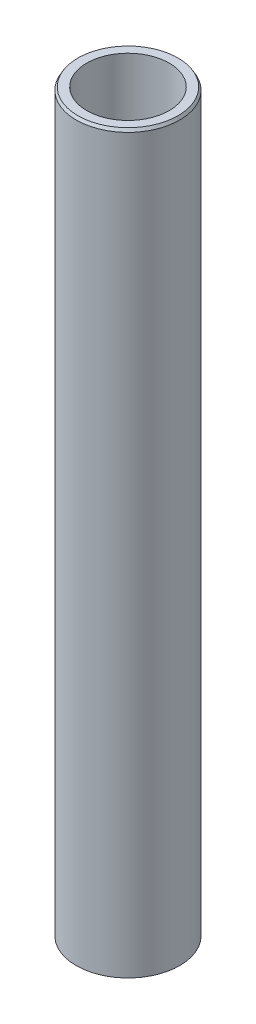
ISO-10303-21;
HEADER;
FILE_DESCRIPTION(('STEP AP214'),'2;1');
FILE_NAME('part.step','',(''),(''),'','','');
FILE_SCHEMA(('AUTOMOTIVE_DESIGN { 1 0 10303 214 1 1 1 1 }'));
ENDSEC;
DATA;
#1=APPLICATION_CONTEXT('core data for automotive mechanical design processes');
#2=APPLICATION_PROTOCOL_DEFINITION('international standard','automotive_design',2000,#1);
#3=PRODUCT_CONTEXT('',#1,'mechanical');
#4=PRODUCT('Part','Part','',(#3));
#5=PRODUCT_RELATED_PRODUCT_CATEGORY('part','',(#4));
#6=PRODUCT_DEFINITION_FORMATION('','',#4);
#7=PRODUCT_DEFINITION_CONTEXT('part definition',#1,'design');
#8=PRODUCT_DEFINITION('design','',#6,#7);
#9=PRODUCT_DEFINITION_SHAPE('','',#8);
#10=(LENGTH_UNIT() NAMED_UNIT(*) SI_UNIT(.MILLI.,.METRE.));
#11=(NAMED_UNIT(*) PLANE_ANGLE_UNIT() SI_UNIT($,.RADIAN.));
#12=(NAMED_UNIT(*) SI_UNIT($,.STERADIAN.) SOLID_ANGLE_UNIT());
#13=UNCERTAINTY_MEASURE_WITH_UNIT(LENGTH_MEASURE(1.E-05),#10,'distance_accuracy_value','');
#14=(GEOMETRIC_REPRESENTATION_CONTEXT(3) GLOBAL_UNCERTAINTY_ASSIGNED_CONTEXT((#13)) GLOBAL_UNIT_ASSIGNED_CONTEXT((#10,
#11,#12)) REPRESENTATION_CONTEXT('',''));
#15=CARTESIAN_POINT('',(0.,0.,0.));
#16=DIRECTION('',(0.,0.,1.));
#17=DIRECTION('',(1.,0.,0.));
#18=AXIS2_PLACEMENT_3D('',#15,#16,#17);
#19=CARTESIAN_POINT('',(0.,284.977533599139,0.));
#20=DIRECTION('',(0.,-1.,0.));
#21=DIRECTION('',(0.,0.,-1.));
#22=AXIS2_PLACEMENT_3D('',#19,#20,#21);
#23=CYLINDRICAL_SURFACE('',#22,20.);
#24=CARTESIAN_POINT('',(0.,283.851731915086,0.));
#25=DIRECTION('',(0.,1.,0.));
#26=DIRECTION('',(0.,0.,1.));
#27=AXIS2_PLACEMENT_3D('',#24,#25,#26);
#28=CIRCLE('',#27,20.);
#29=CARTESIAN_POINT('',(0.,283.851731915086,20.));
#30=VERTEX_POINT('',#29);
#31=EDGE_CURVE('E50',#30,#30,#28,.F.);
#32=ORIENTED_EDGE('',*,*,#31,.T.);
#33=EDGE_LOOP('',(#32));
#34=FACE_BOUND('',#33,.T.);
#35=CARTESIAN_POINT('',(0.,0.649981905342323,0.));
#36=DIRECTION('',(0.,1.,0.));
#37=DIRECTION('',(0.,0.,1.));
#38=AXIS2_PLACEMENT_3D('',#35,#36,#37);
#39=CIRCLE('',#38,20.);
#40=CARTESIAN_POINT('',(0.,0.649981905342323,20.));
#41=VERTEX_POINT('',#40);
#42=EDGE_CURVE('E51',#41,#41,#39,.T.);
#43=ORIENTED_EDGE('',*,*,#42,.T.);
#44=EDGE_LOOP('',(#43));
#45=FACE_BOUND('',#44,.T.);
#46=ADVANCED_FACE('F39',(#34,#45),#23,.T.);
#47=CARTESIAN_POINT('',(0.,284.977533599139,0.));
#48=DIRECTION('',(0.,1.,0.));
#49=DIRECTION('',(0.,0.,1.));
#50=AXIS2_PLACEMENT_3D('',#47,#48,#49);
#51=PLANE('',#50);
#52=CARTESIAN_POINT('',(0.,284.977533599139,0.));
#53=DIRECTION('',(0.,1.,0.));
#54=DIRECTION('',(0.,0.,1.));
#55=AXIS2_PLACEMENT_3D('',#52,#53,#54);
#56=CIRCLE('',#55,19.3500180946577);
#57=CARTESIAN_POINT('',(0.,284.977533599139,19.3500180946577));
#58=VERTEX_POINT('',#57);
#59=EDGE_CURVE('E54',#58,#58,#56,.T.);
#60=ORIENTED_EDGE('',*,*,#59,.T.);
#61=EDGE_LOOP('',(#60));
#62=FACE_BOUND('',#61,.T.);
#63=CARTESIAN_POINT('',(0.,284.977533599139,0.));
#64=DIRECTION('',(0.,1.,0.));
#65=DIRECTION('',(0.,0.,1.));
#66=AXIS2_PLACEMENT_3D('',#63,#64,#65);
#67=CIRCLE('',#66,15.9463163388075);
#68=CARTESIAN_POINT('',(0.,284.977533599139,15.9463163388075));
#69=VERTEX_POINT('',#68);
#70=EDGE_CURVE('E58',#69,#69,#67,.T.);
#71=ORIENTED_EDGE('',*,*,#70,.F.);
#72=EDGE_LOOP('',(#71));
#73=FACE_BOUND('',#72,.T.);
#74=ADVANCED_FACE('F69',(#62,#73),#51,.T.);
#75=CARTESIAN_POINT('',(0.,0.,0.));
#76=DIRECTION('',(0.,1.,0.));
#77=DIRECTION('',(0.,0.,1.));
#78=AXIS2_PLACEMENT_3D('',#75,#76,#77);
#79=PLANE('',#78);
#80=CARTESIAN_POINT('',(0.,0.,0.));
#81=DIRECTION('',(0.,1.,0.));
#82=DIRECTION('',(0.,0.,1.));
#83=AXIS2_PLACEMENT_3D('',#80,#81,#82);
#84=CIRCLE('',#83,18.8741983159467);
#85=CARTESIAN_POINT('',(0.,0.,18.8741983159467));
#86=VERTEX_POINT('',#85);
#87=EDGE_CURVE('E10',#86,#86,#84,.F.);
#88=ORIENTED_EDGE('',*,*,#87,.T.);
#89=EDGE_LOOP('',(#88));
#90=FACE_BOUND('',#89,.T.);
#91=CARTESIAN_POINT('',(0.,0.,0.));
#92=DIRECTION('',(0.,1.,0.));
#93=DIRECTION('',(0.,0.,1.));
#94=AXIS2_PLACEMENT_3D('',#91,#92,#93);
#95=CIRCLE('',#94,15.9463163388075);
#96=CARTESIAN_POINT('',(0.,0.,15.9463163388075));
#97=VERTEX_POINT('',#96);
#98=EDGE_CURVE('E63',#97,#97,#95,.T.);
#99=ORIENTED_EDGE('',*,*,#98,.T.);
#100=EDGE_LOOP('',(#99));
#101=FACE_BOUND('',#100,.T.);
#102=ADVANCED_FACE('F75',(#90,#101),#79,.F.);
#103=CARTESIAN_POINT('',(0.,284.977533599139,0.));
#104=DIRECTION('',(0.,-1.,0.));
#105=DIRECTION('',(0.,0.,-1.));
#106=AXIS2_PLACEMENT_3D('',#103,#104,#105);
#107=CYLINDRICAL_SURFACE('',#106,15.9463163388075);
#108=ORIENTED_EDGE('',*,*,#70,.T.);
#109=EDGE_LOOP('',(#108));
#110=FACE_BOUND('',#109,.T.);
#111=ORIENTED_EDGE('',*,*,#98,.F.);
#112=EDGE_LOOP('',(#111));
#113=FACE_BOUND('',#112,.T.);
#114=ADVANCED_FACE('F70',(#110,#113),#107,.F.);
#115=CARTESIAN_POINT('',(0.,284.977533599139,0.));
#116=DIRECTION('',(0.,-1.,0.));
#117=DIRECTION('',(0.,0.,-1.));
#118=AXIS2_PLACEMENT_3D('',#115,#116,#117);
#119=CONICAL_SURFACE('',#118,19.3500180946577,0.523598775598302);
#120=ORIENTED_EDGE('',*,*,#31,.F.);
#121=EDGE_LOOP('',(#120));
#122=FACE_BOUND('',#121,.T.);
#123=ORIENTED_EDGE('',*,*,#59,.F.);
#124=EDGE_LOOP('',(#123));
#125=FACE_BOUND('',#124,.T.);
#126=ADVANCED_FACE('F81',(#122,#125),#119,.T.);
#127=CARTESIAN_POINT('',(0.,0.649981905342323,0.));
#128=DIRECTION('',(0.,1.,0.));
#129=DIRECTION('',(0.,0.,1.));
#130=AXIS2_PLACEMENT_3D('',#127,#128,#129);
#131=CONICAL_SURFACE('',#130,20.,1.04719755119659);
#132=ORIENTED_EDGE('',*,*,#87,.F.);
#133=EDGE_LOOP('',(#132));
#134=FACE_BOUND('',#133,.T.);
#135=ORIENTED_EDGE('',*,*,#42,.F.);
#136=EDGE_LOOP('',(#135));
#137=FACE_BOUND('',#136,.T.);
#138=ADVANCED_FACE('F45',(#134,#137),#131,.T.);
#139=CLOSED_SHELL('',(#46,#74,#102,#114,#126,#138));
#140=MANIFOLD_SOLID_BREP('B2',#139);
#141=ADVANCED_BREP_SHAPE_REPRESENTATION('',(#18,#140),#14);
#142=SHAPE_DEFINITION_REPRESENTATION(#9,#141);
ENDSEC;
END-ISO-10303-21;
